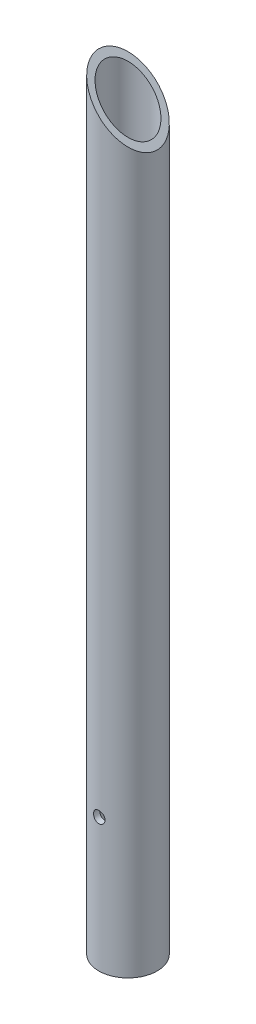
ISO-10303-21;
HEADER;
FILE_DESCRIPTION(('STEP AP214'),'2;1');
FILE_NAME('part.step','',(''),(''),'','','');
FILE_SCHEMA(('AUTOMOTIVE_DESIGN { 1 0 10303 214 1 1 1 1 }'));
ENDSEC;
DATA;
#1=APPLICATION_CONTEXT('core data for automotive mechanical design processes');
#2=APPLICATION_PROTOCOL_DEFINITION('international standard','automotive_design',2000,#1);
#3=PRODUCT_CONTEXT('',#1,'mechanical');
#4=PRODUCT('Part','Part','',(#3));
#5=PRODUCT_RELATED_PRODUCT_CATEGORY('part','',(#4));
#6=PRODUCT_DEFINITION_FORMATION('','',#4);
#7=PRODUCT_DEFINITION_CONTEXT('part definition',#1,'design');
#8=PRODUCT_DEFINITION('design','',#6,#7);
#9=PRODUCT_DEFINITION_SHAPE('','',#8);
#10=(LENGTH_UNIT() NAMED_UNIT(*) SI_UNIT(.MILLI.,.METRE.));
#11=(NAMED_UNIT(*) PLANE_ANGLE_UNIT() SI_UNIT($,.RADIAN.));
#12=(NAMED_UNIT(*) SI_UNIT($,.STERADIAN.) SOLID_ANGLE_UNIT());
#13=UNCERTAINTY_MEASURE_WITH_UNIT(LENGTH_MEASURE(1.E-05),#10,'distance_accuracy_value','');
#14=(GEOMETRIC_REPRESENTATION_CONTEXT(3) GLOBAL_UNCERTAINTY_ASSIGNED_CONTEXT((#13)) GLOBAL_UNIT_ASSIGNED_CONTEXT((#10,
#11,#12)) REPRESENTATION_CONTEXT('',''));
#15=CARTESIAN_POINT('',(0.,0.,0.));
#16=DIRECTION('',(0.,0.,1.));
#17=DIRECTION('',(1.,0.,0.));
#18=AXIS2_PLACEMENT_3D('',#15,#16,#17);
#19=CARTESIAN_POINT('',(0.,76.2,20.0406));
#20=DIRECTION('',(0.,0.,-1.));
#21=DIRECTION('',(-1.,0.,0.));
#22=AXIS2_PLACEMENT_3D('',#19,#20,#21);
#23=CYLINDRICAL_SURFACE('',#22,3.302);
#24=CARTESIAN_POINT('',(-3.302,76.2,16.3708123271266));
#25=CARTESIAN_POINT('',(-3.30199120234706,76.3833287547714,16.370816838591));
#26=CARTESIAN_POINT('',(-3.28666629725176,76.5668858268226,16.3739282706998));
#27=CARTESIAN_POINT('',(-3.22577913606345,76.9289566977053,16.386029838558));
#28=CARTESIAN_POINT('',(-3.18015678030354,77.1074597358098,16.3950316582785));
#29=CARTESIAN_POINT('',(-3.060138086062,77.4539139258851,16.4178548507634));
#30=CARTESIAN_POINT('',(-2.98578312075264,77.6218798482613,16.4316692908501));
#31=CARTESIAN_POINT('',(-2.81050949515337,77.9428962740822,16.4625519787775));
#32=CARTESIAN_POINT('',(-2.70959960391072,78.0959516785034,16.4796191519786));
#33=CARTESIAN_POINT('',(-2.48257124423567,78.3850020083973,16.5153526470844));
#34=CARTESIAN_POINT('',(-2.3561532549857,78.5207595965224,16.5340363009441));
#35=CARTESIAN_POINT('',(-2.08233848475013,78.7692922516048,16.5707457114895));
#36=CARTESIAN_POINT('',(-1.93493914218847,78.8820645082295,16.5887713875058));
#37=CARTESIAN_POINT('',(-1.62179856876697,79.0823254145867,16.6223174077456));
#38=CARTESIAN_POINT('',(-1.45591227965559,79.1695913462381,16.6378151894775));
#39=CARTESIAN_POINT('',(-1.11147589342289,79.3149245729163,16.664366705757));
#40=CARTESIAN_POINT('',(-0.932927063763604,79.3729947856064,16.6754208843524));
#41=CARTESIAN_POINT('',(-0.57067351808839,79.4575578431062,16.6917185219859));
#42=CARTESIAN_POINT('',(-0.387064848766468,79.4844478283264,16.6970349998164));
#43=CARTESIAN_POINT('',(-0.0178701767883407,79.5071258552693,16.7015103072479));
#44=CARTESIAN_POINT('',(0.167715640957956,79.5029167804259,16.7006697077192));
#45=CARTESIAN_POINT('',(0.53286669095821,79.463818088652,16.6929822544683));
#46=CARTESIAN_POINT('',(0.712479772753454,79.429356479101,16.6862191939152));
#47=CARTESIAN_POINT('',(1.06332383791853,79.3314090044509,16.6675410519917));
#48=CARTESIAN_POINT('',(1.23455442729845,79.2679217765509,16.6556257287153));
#49=CARTESIAN_POINT('',(1.56500133231594,79.1133243200546,16.6278429902022));
#50=CARTESIAN_POINT('',(1.72413639187263,79.0220449172934,16.6119514801186));
#51=CARTESIAN_POINT('',(2.02497763659662,78.8145863928103,16.5779708611867));
#52=CARTESIAN_POINT('',(2.16668314226013,78.6984063008007,16.5598816667148));
#53=CARTESIAN_POINT('',(2.43117128885855,78.4421168854028,16.5231433116127));
#54=CARTESIAN_POINT('',(2.55359464160904,78.3016371678917,16.5044898519119));
#55=CARTESIAN_POINT('',(2.77325590848956,78.0018842186074,16.4690065392469));
#56=CARTESIAN_POINT('',(2.87048261267331,77.8426026676409,16.4521774998943));
#57=CARTESIAN_POINT('',(3.03710510185893,77.5092143633048,16.4222382154061));
#58=CARTESIAN_POINT('',(3.10642109660303,77.3350668076119,16.4091386628474));
#59=CARTESIAN_POINT('',(3.2145675191706,76.9775019743356,16.3882987934198));
#60=CARTESIAN_POINT('',(3.25346223236521,76.7941051204794,16.3805471795544));
#61=CARTESIAN_POINT('',(3.28504928670894,76.5410966173695,16.3742234759928));
#62=CARTESIAN_POINT('',(3.29140035559216,76.4730478372924,16.3729472949643));
#63=CARTESIAN_POINT('',(3.29987735592536,76.3366766184731,16.3712408787632));
#64=CARTESIAN_POINT('',(3.30200328020744,76.2683541792668,16.3708106450258));
#65=CARTESIAN_POINT('',(3.30199120234706,76.0166712452285,16.370816838591));
#66=CARTESIAN_POINT('',(3.28666629725176,75.8331141731774,16.3739282706998));
#67=CARTESIAN_POINT('',(3.22577913606345,75.4710433022946,16.386029838558));
#68=CARTESIAN_POINT('',(3.18015678030354,75.2925402641902,16.3950316582785));
#69=CARTESIAN_POINT('',(3.060138086062,74.9460860741149,16.4178548507634));
#70=CARTESIAN_POINT('',(2.98578312075264,74.7781201517386,16.4316692908501));
#71=CARTESIAN_POINT('',(2.81050949515337,74.4571037259178,16.4625519787775));
#72=CARTESIAN_POINT('',(2.70959960391072,74.3040483214965,16.4796191519786));
#73=CARTESIAN_POINT('',(2.48257124423567,74.0149979916027,16.5153526470844));
#74=CARTESIAN_POINT('',(2.3561532549857,73.8792404034776,16.5340363009441));
#75=CARTESIAN_POINT('',(2.08233848475013,73.6307077483952,16.5707457114895));
#76=CARTESIAN_POINT('',(1.93493914218847,73.5179354917704,16.5887713875058));
#77=CARTESIAN_POINT('',(1.62179856876697,73.3176745854133,16.6223174077456));
#78=CARTESIAN_POINT('',(1.45591227965559,73.2304086537619,16.6378151894775));
#79=CARTESIAN_POINT('',(1.11147589342289,73.0850754270837,16.664366705757));
#80=CARTESIAN_POINT('',(0.932927063763608,73.0270052143936,16.6754208843524));
#81=CARTESIAN_POINT('',(0.570673518088389,72.9424421568937,16.6917185219859));
#82=CARTESIAN_POINT('',(0.387064848766467,72.9155521716736,16.6970349998164));
#83=CARTESIAN_POINT('',(0.0178701767883409,72.8928741447307,16.7015103072479));
#84=CARTESIAN_POINT('',(-0.167715640957956,72.8970832195741,16.7006697077192));
#85=CARTESIAN_POINT('',(-0.53286669095821,72.936181911348,16.6929822544683));
#86=CARTESIAN_POINT('',(-0.712479772753454,72.970643520899,16.6862191939152));
#87=CARTESIAN_POINT('',(-1.06332383791853,73.068590995549,16.6675410519917));
#88=CARTESIAN_POINT('',(-1.23455442729845,73.132078223449,16.6556257287153));
#89=CARTESIAN_POINT('',(-1.56500133231594,73.2866756799454,16.6278429902022));
#90=CARTESIAN_POINT('',(-1.72413639187263,73.3779550827065,16.6119514801186));
#91=CARTESIAN_POINT('',(-2.02497763659662,73.5854136071897,16.5779708611867));
#92=CARTESIAN_POINT('',(-2.16668314226013,73.7015936991992,16.5598816667148));
#93=CARTESIAN_POINT('',(-2.43117128885855,73.9578831145972,16.5231433116127));
#94=CARTESIAN_POINT('',(-2.55359464160905,74.0983628321083,16.5044898519119));
#95=CARTESIAN_POINT('',(-2.77325590848956,74.3981157813926,16.4690065392469));
#96=CARTESIAN_POINT('',(-2.87048261267331,74.557397332359,16.4521774998943));
#97=CARTESIAN_POINT('',(-3.03710510185893,74.8907856366951,16.4222382154061));
#98=CARTESIAN_POINT('',(-3.10642109660303,75.0649331923881,16.4091386628474));
#99=CARTESIAN_POINT('',(-3.21456751917059,75.4224980256644,16.3882987934198));
#100=CARTESIAN_POINT('',(-3.25346223236521,75.6058948795206,16.3805471795544));
#101=CARTESIAN_POINT('',(-3.28504928670894,75.8589033826305,16.3742234759928));
#102=CARTESIAN_POINT('',(-3.29140035559216,75.9269521627076,16.3729472949643));
#103=CARTESIAN_POINT('',(-3.29987735592536,76.0633233815269,16.3712408787632));
#104=CARTESIAN_POINT('',(-3.30200328020744,76.1316458207332,16.3708106450258));
#105=CARTESIAN_POINT('',(-3.302,76.2,16.3708123271266));
#106=B_SPLINE_CURVE_WITH_KNOTS('',3,(#24,#25,#26,#27,#28,#29,#30,#31,#32,#33,#34,#35,#36,#37,
#38,#39,#40,#41,#42,#43,#44,#45,#46,#47,#48,#49,#50,#51,#52,#53,#54,#55,#56,#57,#58,#59,#60,#61,
#62,#63,#64,#65,#66,#67,#68,#69,#70,#71,#72,#73,#74,#75,#76,#77,#78,#79,#80,#81,#82,#83,#84,#85,
#86,#87,#88,#89,#90,#91,#92,#93,#94,#95,#96,#97,#98,#99,#100,#101,#102,#103,#104,#105),
.UNSPECIFIED.,.T.,.F.,(4,2,2,2,2,2,2,2,2,2,2,2,2,2,2,2,2,2,2,2,2,2,2,2,2,2,2,2,2,2,2,2,2,2,2,2,
2,2,2,2,4),(0.,0.549724742367447,1.10054321885154,1.65057148881832,2.20041835422822,
2.7571426870942,3.31393504783329,3.8754531759231,4.43691517774535,4.99114447696647,
5.54532238995423,6.09178401127641,6.63827129251496,7.18815396349284,7.73805806525502,
8.29723279692203,8.85665587904593,9.4176670576288,9.97748949635796,10.1824541779053,
10.3874192071722,10.9371439495396,11.4879624260237,12.0379906959905,12.5878375614004,
13.1445618942664,13.7013542550055,14.2628723830953,14.8243343849175,15.3785636841387,
15.9327415971264,16.4792032184486,17.0256904996871,17.575573170665,18.1254772724272,
18.6846520040942,19.2440750862181,19.805086264801,20.3649087035302,20.5698733850775,
20.7748384143444),.UNSPECIFIED.);
#107=CARTESIAN_POINT('',(-3.302,76.2,16.3708123271266));
#108=VERTEX_POINT('',#107);
#109=EDGE_CURVE('E46',#108,#108,#106,.T.);
#110=ORIENTED_EDGE('',*,*,#109,.F.);
#111=EDGE_LOOP('',(#110));
#112=FACE_BOUND('',#111,.T.);
#113=CARTESIAN_POINT('',(3.302,76.2,12.9066058005194));
#114=CARTESIAN_POINT('',(3.30199063208015,76.0178187283405,12.9066117867371));
#115=CARTESIAN_POINT('',(3.28685540031462,75.8354219256333,12.9105096998557));
#116=CARTESIAN_POINT('',(3.22675836918239,75.4757015883572,12.9256576757505));
#117=CARTESIAN_POINT('',(3.18173992870915,75.2983883563444,12.9369216997672));
#118=CARTESIAN_POINT('',(3.0634183087209,74.9543308631637,12.9654470693106));
#119=CARTESIAN_POINT('',(2.99016565854179,74.7875683371002,12.9826976954549));
#120=CARTESIAN_POINT('',(2.8175877818168,74.4687370261311,13.021238721081));
#121=CARTESIAN_POINT('',(2.71826913298133,74.3166645474432,13.042528101015));
#122=CARTESIAN_POINT('',(2.49406009166967,74.0281594425211,13.0872697707412));
#123=CARTESIAN_POINT('',(2.3687061886504,73.8920922346542,13.110756303134));
#124=CARTESIAN_POINT('',(2.09697754820616,73.6426755238184,13.1569496859324));
#125=CARTESIAN_POINT('',(1.95059972990895,73.5293293562629,13.1796564214603));
#126=CARTESIAN_POINT('',(1.63850231056603,73.3271006156521,13.2221060045578));
#127=CARTESIAN_POINT('',(1.47254557218511,73.2385738000642,13.2418040718838));
#128=CARTESIAN_POINT('',(1.12753839690126,73.0908101391158,13.2756292981495));
#129=CARTESIAN_POINT('',(0.948489964109988,73.031568821384,13.2897573076608));
#130=CARTESIAN_POINT('',(0.58616689181204,72.9452187119843,13.3106101948568));
#131=CARTESIAN_POINT('',(0.403047532571587,72.9174932254366,13.3174769649403));
#132=CARTESIAN_POINT('',(0.0346363502121916,72.8930266113245,13.3235279332403));
#133=CARTESIAN_POINT('',(-0.150655155898091,72.8962810173437,13.3227132389048));
#134=CARTESIAN_POINT('',(-0.513873987073934,72.9332370538401,13.3135989130709));
#135=CARTESIAN_POINT('',(-0.691873781128171,72.9662728672424,13.3054629684576));
#136=CARTESIAN_POINT('',(-1.03972142896235,73.0607847958827,13.2828105218201));
#137=CARTESIAN_POINT('',(-1.20956879954739,73.1222625945881,13.2682936421141));
#138=CARTESIAN_POINT('',(-1.53805462375157,73.2724577111634,13.2342586375848));
#139=CARTESIAN_POINT('',(-1.69657917140658,73.3614138632733,13.2146969207924));
#140=CARTESIAN_POINT('',(-1.99667380698015,73.5638534090277,13.1726976383115));
#141=CARTESIAN_POINT('',(-2.13824212008747,73.6773393667294,13.150259772084));
#142=CARTESIAN_POINT('',(-2.40436498149018,73.9291692689648,13.1042530544457));
#143=CARTESIAN_POINT('',(-2.52837068734241,74.0680911481325,13.0806699855788));
#144=CARTESIAN_POINT('',(-2.75149721286467,74.3650699397459,13.035564508723));
#145=CARTESIAN_POINT('',(-2.85060696254605,74.5231353182143,13.014043020038));
#146=CARTESIAN_POINT('',(-3.02147037254645,74.8550233605018,12.9754436523584));
#147=CARTESIAN_POINT('',(-3.09307186641119,75.0289272717116,12.9583906519881));
#148=CARTESIAN_POINT('',(-3.20571768463233,75.3866164701759,12.9309886202543));
#149=CARTESIAN_POINT('',(-3.246826362328,75.570380064541,12.920625476367));
#150=CARTESIAN_POINT('',(-3.28201493247129,75.8297137601012,12.9117049788461));
#151=CARTESIAN_POINT('',(-3.28950207800369,75.9035485231215,12.9097978475782));
#152=CARTESIAN_POINT('',(-3.29949652854945,76.0515769295719,12.9072470367696));
#153=CARTESIAN_POINT('',(-3.3020038169418,76.1257705741991,12.9066033614459));
#154=CARTESIAN_POINT('',(-3.30199063208015,76.3821812716595,12.9066117867371));
#155=CARTESIAN_POINT('',(-3.28685540031462,76.5645780743666,12.9105096998557));
#156=CARTESIAN_POINT('',(-3.22675836918239,76.9242984116428,12.9256576757505));
#157=CARTESIAN_POINT('',(-3.18173992870915,77.1016116436556,12.9369216997672));
#158=CARTESIAN_POINT('',(-3.0634183087209,77.4456691368362,12.9654470693106));
#159=CARTESIAN_POINT('',(-2.99016565854179,77.6124316628997,12.9826976954549));
#160=CARTESIAN_POINT('',(-2.8175877818168,77.9312629738689,13.021238721081));
#161=CARTESIAN_POINT('',(-2.71826913298133,78.0833354525568,13.042528101015));
#162=CARTESIAN_POINT('',(-2.49406009166967,78.3718405574789,13.0872697707412));
#163=CARTESIAN_POINT('',(-2.3687061886504,78.5079077653458,13.110756303134));
#164=CARTESIAN_POINT('',(-2.09697754820616,78.7573244761816,13.1569496859324));
#165=CARTESIAN_POINT('',(-1.95059972990895,78.8706706437371,13.1796564214603));
#166=CARTESIAN_POINT('',(-1.63850231056603,79.0728993843478,13.2221060045578));
#167=CARTESIAN_POINT('',(-1.47254557218511,79.1614261999358,13.2418040718838));
#168=CARTESIAN_POINT('',(-1.12753839690126,79.3091898608841,13.2756292981495));
#169=CARTESIAN_POINT('',(-0.948489964109988,79.368431178616,13.2897573076608));
#170=CARTESIAN_POINT('',(-0.586166891812039,79.4547812880156,13.3106101948568));
#171=CARTESIAN_POINT('',(-0.403047532571586,79.4825067745634,13.3174769649403));
#172=CARTESIAN_POINT('',(-0.0346363502121906,79.5069733886754,13.3235279332403));
#173=CARTESIAN_POINT('',(0.150655155898091,79.5037189826563,13.3227132389048));
#174=CARTESIAN_POINT('',(0.513873987073934,79.4667629461598,13.3135989130709));
#175=CARTESIAN_POINT('',(0.69187378112817,79.4337271327575,13.3054629684576));
#176=CARTESIAN_POINT('',(1.03972142896235,79.3392152041172,13.2828105218201));
#177=CARTESIAN_POINT('',(1.20956879954739,79.2777374054119,13.2682936421141));
#178=CARTESIAN_POINT('',(1.53805462375157,79.1275422888366,13.2342586375848));
#179=CARTESIAN_POINT('',(1.69657917140658,79.0385861367267,13.2146969207924));
#180=CARTESIAN_POINT('',(1.99667380698015,78.8361465909723,13.1726976383115));
#181=CARTESIAN_POINT('',(2.13824212008747,78.7226606332706,13.150259772084));
#182=CARTESIAN_POINT('',(2.40436498149018,78.4708307310352,13.1042530544457));
#183=CARTESIAN_POINT('',(2.52837068734241,78.3319088518675,13.0806699855788));
#184=CARTESIAN_POINT('',(2.75149721286467,78.034930060254,13.035564508723));
#185=CARTESIAN_POINT('',(2.85060696254605,77.8768646817857,13.014043020038));
#186=CARTESIAN_POINT('',(3.02147037254645,77.5449766394982,12.9754436523584));
#187=CARTESIAN_POINT('',(3.09307186641119,77.3710727282884,12.9583906519881));
#188=CARTESIAN_POINT('',(3.20571768463233,77.0133835298241,12.9309886202543));
#189=CARTESIAN_POINT('',(3.246826362328,76.829619935459,12.920625476367));
#190=CARTESIAN_POINT('',(3.28201493247129,76.5702862398987,12.9117049788461));
#191=CARTESIAN_POINT('',(3.28950207800369,76.4964514768785,12.9097978475782));
#192=CARTESIAN_POINT('',(3.29949652854945,76.348423070428,12.9072470367696));
#193=CARTESIAN_POINT('',(3.3020038169418,76.2742294258009,12.9066033614459));
#194=CARTESIAN_POINT('',(3.302,76.2,12.9066058005194));
#195=B_SPLINE_CURVE_WITH_KNOTS('',3,(#113,#114,#115,#116,#117,#118,#119,#120,#121,#122,#123,
#124,#125,#126,#127,#128,#129,#130,#131,#132,#133,#134,#135,#136,#137,#138,#139,#140,#141,#142,
#143,#144,#145,#146,#147,#148,#149,#150,#151,#152,#153,#154,#155,#156,#157,#158,#159,#160,#161,
#162,#163,#164,#165,#166,#167,#168,#169,#170,#171,#172,#173,#174,#175,#176,#177,#178,#179,#180,
#181,#182,#183,#184,#185,#186,#187,#188,#189,#190,#191,#192,#193,#194),.UNSPECIFIED.,.T.,.F.,(4,
2,2,2,2,2,2,2,2,2,2,2,2,2,2,2,2,2,2,2,2,2,2,2,2,2,2,2,2,2,2,2,2,2,2,2,2,2,2,2,4),(0.,
0.546258625992837,1.09355560700881,1.63987763239607,2.18606192668676,2.74296298910197,
3.29994574395507,3.86454567125445,4.42905934831158,4.98232559406963,5.53551207582849,
6.07662967107866,6.61777929891613,7.16377149275347,7.7098207858137,8.27030833162596,
8.83104465886005,9.39483960114977,9.95744127453622,10.180012609345,10.4025846870173,
10.9488433130101,11.4961402940261,12.0424623194134,12.5886466137041,13.1455476761193,
13.7025304309724,14.2671303582718,14.8316440353289,15.3849102810869,15.9380967628458,
16.479214358096,17.0203639859334,17.5663561797708,18.112405472831,18.6728930186433,
19.2336293458774,19.7974242881671,20.3600259615535,20.5825972963623,20.8051693740346),.UNSPECIFIED.);
#196=CARTESIAN_POINT('',(3.302,76.2,12.9066058005194));
#197=VERTEX_POINT('',#196);
#198=EDGE_CURVE('E19',#197,#197,#195,.T.);
#199=ORIENTED_EDGE('',*,*,#198,.T.);
#200=EDGE_LOOP('',(#199));
#201=FACE_BOUND('',#200,.T.);
#202=ADVANCED_FACE('F15',(#112,#201),#23,.F.);
#203=CARTESIAN_POINT('',(0.,0.,0.));
#204=DIRECTION('',(0.,1.,0.));
#205=DIRECTION('',(0.,0.,1.));
#206=AXIS2_PLACEMENT_3D('',#203,#204,#205);
#207=CYLINDRICAL_SURFACE('',#206,13.3223);
#208=CARTESIAN_POINT('',(0.,0.,0.));
#209=DIRECTION('',(0.,1.,0.));
#210=DIRECTION('',(0.,0.,1.));
#211=AXIS2_PLACEMENT_3D('',#208,#209,#210);
#212=CIRCLE('',#211,13.3223);
#213=CARTESIAN_POINT('',(0.,0.,13.3223));
#214=VERTEX_POINT('',#213);
#215=EDGE_CURVE('E52',#214,#214,#212,.F.);
#216=ORIENTED_EDGE('',*,*,#215,.T.);
#217=EDGE_LOOP('',(#216));
#218=FACE_BOUND('',#217,.T.);
#219=CARTESIAN_POINT('',(-3.302,76.2,-12.9066058005194));
#220=CARTESIAN_POINT('',(-3.30199063208015,76.3821812716595,-12.9066117867371));
#221=CARTESIAN_POINT('',(-3.28685540031461,76.5645780743667,-12.9105096998557));
#222=CARTESIAN_POINT('',(-3.22675836918239,76.9242984116428,-12.9256576757505));
#223=CARTESIAN_POINT('',(-3.18173992870915,77.1016116436556,-12.9369216997672));
#224=CARTESIAN_POINT('',(-3.0634183087209,77.4456691368362,-12.9654470693106));
#225=CARTESIAN_POINT('',(-2.99016565854179,77.6124316628997,-12.9826976954549));
#226=CARTESIAN_POINT('',(-2.8175877818168,77.9312629738689,-13.021238721081));
#227=CARTESIAN_POINT('',(-2.71826913298133,78.0833354525568,-13.042528101015));
#228=CARTESIAN_POINT('',(-2.49406009166967,78.3718405574789,-13.0872697707412));
#229=CARTESIAN_POINT('',(-2.3687061886504,78.5079077653458,-13.110756303134));
#230=CARTESIAN_POINT('',(-2.09697754820616,78.7573244761816,-13.1569496859324));
#231=CARTESIAN_POINT('',(-1.95059972990895,78.8706706437371,-13.1796564214603));
#232=CARTESIAN_POINT('',(-1.63850231056603,79.0728993843478,-13.2221060045578));
#233=CARTESIAN_POINT('',(-1.47254557218511,79.1614261999358,-13.2418040718838));
#234=CARTESIAN_POINT('',(-1.12753839690126,79.3091898608841,-13.2756292981495));
#235=CARTESIAN_POINT('',(-0.948489964109988,79.368431178616,-13.2897573076608));
#236=CARTESIAN_POINT('',(-0.58616689181204,79.4547812880156,-13.3106101948568));
#237=CARTESIAN_POINT('',(-0.403047532571587,79.4825067745634,-13.3174769649403));
#238=CARTESIAN_POINT('',(-0.0346363502121916,79.5069733886754,-13.3235279332403));
#239=CARTESIAN_POINT('',(0.150655155898091,79.5037189826563,-13.3227132389048));
#240=CARTESIAN_POINT('',(0.513873987073934,79.4667629461598,-13.3135989130709));
#241=CARTESIAN_POINT('',(0.691873781128171,79.4337271327575,-13.3054629684576));
#242=CARTESIAN_POINT('',(1.03972142896235,79.3392152041172,-13.2828105218201));
#243=CARTESIAN_POINT('',(1.20956879954739,79.2777374054119,-13.2682936421141));
#244=CARTESIAN_POINT('',(1.53805462375157,79.1275422888366,-13.2342586375848));
#245=CARTESIAN_POINT('',(1.69657917140658,79.0385861367267,-13.2146969207924));
#246=CARTESIAN_POINT('',(1.99667380698015,78.8361465909723,-13.1726976383115));
#247=CARTESIAN_POINT('',(2.13824212008747,78.7226606332706,-13.150259772084));
#248=CARTESIAN_POINT('',(2.40436498149018,78.4708307310352,-13.1042530544457));
#249=CARTESIAN_POINT('',(2.52837068734241,78.3319088518675,-13.0806699855788));
#250=CARTESIAN_POINT('',(2.75149721286467,78.034930060254,-13.035564508723));
#251=CARTESIAN_POINT('',(2.85060696254605,77.8768646817857,-13.014043020038));
#252=CARTESIAN_POINT('',(3.02147037254645,77.5449766394982,-12.9754436523584));
#253=CARTESIAN_POINT('',(3.09307186641119,77.3710727282884,-12.9583906519881));
#254=CARTESIAN_POINT('',(3.20571768463233,77.0133835298241,-12.9309886202543));
#255=CARTESIAN_POINT('',(3.246826362328,76.829619935459,-12.920625476367));
#256=CARTESIAN_POINT('',(3.28201493247129,76.5702862398987,-12.9117049788461));
#257=CARTESIAN_POINT('',(3.28950207800369,76.4964514768785,-12.9097978475782));
#258=CARTESIAN_POINT('',(3.29949652854945,76.348423070428,-12.9072470367696));
#259=CARTESIAN_POINT('',(3.3020038169418,76.2742294258009,-12.9066033614459));
#260=CARTESIAN_POINT('',(3.30199063208015,76.0178187283405,-12.9066117867371));
#261=CARTESIAN_POINT('',(3.28685540031461,75.8354219256333,-12.9105096998557));
#262=CARTESIAN_POINT('',(3.22675836918239,75.4757015883572,-12.9256576757505));
#263=CARTESIAN_POINT('',(3.18173992870915,75.2983883563444,-12.9369216997672));
#264=CARTESIAN_POINT('',(3.0634183087209,74.9543308631637,-12.9654470693106));
#265=CARTESIAN_POINT('',(2.99016565854179,74.7875683371002,-12.9826976954549));
#266=CARTESIAN_POINT('',(2.8175877818168,74.4687370261311,-13.021238721081));
#267=CARTESIAN_POINT('',(2.71826913298133,74.3166645474432,-13.042528101015));
#268=CARTESIAN_POINT('',(2.49406009166967,74.0281594425211,-13.0872697707412));
#269=CARTESIAN_POINT('',(2.3687061886504,73.8920922346542,-13.110756303134));
#270=CARTESIAN_POINT('',(2.09697754820616,73.6426755238184,-13.1569496859324));
#271=CARTESIAN_POINT('',(1.95059972990895,73.5293293562629,-13.1796564214603));
#272=CARTESIAN_POINT('',(1.63850231056603,73.3271006156521,-13.2221060045578));
#273=CARTESIAN_POINT('',(1.47254557218511,73.2385738000642,-13.2418040718838));
#274=CARTESIAN_POINT('',(1.12753839690126,73.0908101391158,-13.2756292981495));
#275=CARTESIAN_POINT('',(0.948489964109988,73.031568821384,-13.2897573076608));
#276=CARTESIAN_POINT('',(0.586166891812039,72.9452187119843,-13.3106101948568));
#277=CARTESIAN_POINT('',(0.403047532571586,72.9174932254366,-13.3174769649403));
#278=CARTESIAN_POINT('',(0.0346363502121906,72.8930266113245,-13.3235279332403));
#279=CARTESIAN_POINT('',(-0.150655155898092,72.8962810173437,-13.3227132389048));
#280=CARTESIAN_POINT('',(-0.513873987073932,72.9332370538401,-13.3135989130709));
#281=CARTESIAN_POINT('',(-0.691873781128165,72.9662728672424,-13.3054629684576));
#282=CARTESIAN_POINT('',(-1.03972142896235,73.0607847958827,-13.2828105218201));
#283=CARTESIAN_POINT('',(-1.20956879954739,73.1222625945881,-13.2682936421141));
#284=CARTESIAN_POINT('',(-1.53805462375157,73.2724577111634,-13.2342586375848));
#285=CARTESIAN_POINT('',(-1.69657917140657,73.3614138632733,-13.2146969207924));
#286=CARTESIAN_POINT('',(-1.99667380698014,73.5638534090277,-13.1726976383115));
#287=CARTESIAN_POINT('',(-2.13824212008747,73.6773393667294,-13.150259772084));
#288=CARTESIAN_POINT('',(-2.40436498149018,73.9291692689648,-13.1042530544457));
#289=CARTESIAN_POINT('',(-2.52837068734241,74.0680911481325,-13.0806699855788));
#290=CARTESIAN_POINT('',(-2.75149721286467,74.3650699397459,-13.035564508723));
#291=CARTESIAN_POINT('',(-2.85060696254605,74.5231353182143,-13.014043020038));
#292=CARTESIAN_POINT('',(-3.02147037254645,74.8550233605018,-12.9754436523584));
#293=CARTESIAN_POINT('',(-3.09307186641119,75.0289272717116,-12.9583906519881));
#294=CARTESIAN_POINT('',(-3.20571768463233,75.3866164701759,-12.9309886202543));
#295=CARTESIAN_POINT('',(-3.246826362328,75.570380064541,-12.920625476367));
#296=CARTESIAN_POINT('',(-3.28201493247129,75.8297137601012,-12.9117049788461));
#297=CARTESIAN_POINT('',(-3.28950207800369,75.9035485231215,-12.9097978475782));
#298=CARTESIAN_POINT('',(-3.29949652854945,76.0515769295719,-12.9072470367696));
#299=CARTESIAN_POINT('',(-3.3020038169418,76.1257705741991,-12.9066033614459));
#300=CARTESIAN_POINT('',(-3.302,76.2,-12.9066058005194));
#301=B_SPLINE_CURVE_WITH_KNOTS('',3,(#219,#220,#221,#222,#223,#224,#225,#226,#227,#228,#229,
#230,#231,#232,#233,#234,#235,#236,#237,#238,#239,#240,#241,#242,#243,#244,#245,#246,#247,#248,
#249,#250,#251,#252,#253,#254,#255,#256,#257,#258,#259,#260,#261,#262,#263,#264,#265,#266,#267,
#268,#269,#270,#271,#272,#273,#274,#275,#276,#277,#278,#279,#280,#281,#282,#283,#284,#285,#286,
#287,#288,#289,#290,#291,#292,#293,#294,#295,#296,#297,#298,#299,#300),.UNSPECIFIED.,.T.,.F.,(4,
2,2,2,2,2,2,2,2,2,2,2,2,2,2,2,2,2,2,2,2,2,2,2,2,2,2,2,2,2,2,2,2,2,2,2,2,2,2,2,4),(0.,
0.546258625992851,1.09355560700881,1.63987763239607,2.18606192668676,2.74296298910197,
3.29994574395507,3.86454567125445,4.42905934831158,4.98232559406963,5.53551207582849,
6.07662967107866,6.61777929891613,7.16377149275347,7.7098207858137,8.27030833162596,
8.83104465886005,9.39483960114977,9.95744127453622,10.180012609345,10.4025846870173,
10.9488433130102,11.4961402940261,12.0424623194134,12.5886466137041,13.1455476761193,
13.7025304309724,14.2671303582718,14.8316440353289,15.3849102810869,15.9380967628458,
16.479214358096,17.0203639859334,17.5663561797708,18.112405472831,18.6728930186433,
19.2336293458774,19.7974242881671,20.3600259615535,20.5825972963623,20.8051693740346),.UNSPECIFIED.);
#302=CARTESIAN_POINT('',(-3.302,76.2,-12.9066058005194));
#303=VERTEX_POINT('',#302);
#304=EDGE_CURVE('E76',#303,#303,#301,.T.);
#305=ORIENTED_EDGE('',*,*,#304,.T.);
#306=EDGE_LOOP('',(#305));
#307=FACE_BOUND('',#306,.T.);
#308=CARTESIAN_POINT('',(0.,423.1005,0.));
#309=DIRECTION('',(-0.707106781186548,-0.707106781186548,0.));
#310=DIRECTION('',(-0.707106781186548,0.707106781186548,0.));
#311=AXIS2_PLACEMENT_3D('',#308,#309,#310);
#312=ELLIPSE('',#311,18.8405773420031,13.3223);
#313=CARTESIAN_POINT('',(-13.3223,436.4228,0.));
#314=VERTEX_POINT('',#313);
#315=EDGE_CURVE('E51',#314,#314,#312,.F.);
#316=ORIENTED_EDGE('',*,*,#315,.T.);
#317=EDGE_LOOP('',(#316));
#318=FACE_BOUND('',#317,.T.);
#319=ORIENTED_EDGE('',*,*,#198,.F.);
#320=EDGE_LOOP('',(#319));
#321=FACE_BOUND('',#320,.T.);
#322=ADVANCED_FACE('F61',(#218,#307,#318,#321),#207,.F.);
#323=CARTESIAN_POINT('',(0.,0.,0.));
#324=DIRECTION('',(0.,1.,0.));
#325=DIRECTION('',(0.,0.,1.));
#326=AXIS2_PLACEMENT_3D('',#323,#324,#325);
#327=PLANE('',#326);
#328=ORIENTED_EDGE('',*,*,#215,.F.);
#329=EDGE_LOOP('',(#328));
#330=FACE_BOUND('',#329,.T.);
#331=CARTESIAN_POINT('',(0.,0.,0.));
#332=DIRECTION('',(0.,1.,0.));
#333=DIRECTION('',(0.,0.,1.));
#334=AXIS2_PLACEMENT_3D('',#331,#332,#333);
#335=CIRCLE('',#334,16.7005);
#336=CARTESIAN_POINT('',(0.,0.,16.7005));
#337=VERTEX_POINT('',#336);
#338=EDGE_CURVE('E30',#337,#337,#335,.T.);
#339=ORIENTED_EDGE('',*,*,#338,.F.);
#340=EDGE_LOOP('',(#339));
#341=FACE_BOUND('',#340,.T.);
#342=ADVANCED_FACE('F63',(#330,#341),#327,.F.);
#343=CARTESIAN_POINT('',(-16.7005,439.801,-55.2958));
#344=DIRECTION('',(-0.707106781186548,-0.707106781186548,0.));
#345=DIRECTION('',(0.707106781186548,-0.707106781186548,0.));
#346=AXIS2_PLACEMENT_3D('',#343,#344,#345);
#347=PLANE('',#346);
#348=ORIENTED_EDGE('',*,*,#315,.F.);
#349=EDGE_LOOP('',(#348));
#350=FACE_BOUND('',#349,.T.);
#351=CARTESIAN_POINT('',(0.,423.1005,0.));
#352=DIRECTION('',(-0.707106781186548,-0.707106781186548,0.));
#353=DIRECTION('',(-0.707106781186548,0.707106781186548,0.));
#354=AXIS2_PLACEMENT_3D('',#351,#352,#353);
#355=ELLIPSE('',#354,23.6180735984119,16.7005);
#356=CARTESIAN_POINT('',(-16.7005,439.801,0.));
#357=VERTEX_POINT('',#356);
#358=EDGE_CURVE('E25',#357,#357,#355,.T.);
#359=ORIENTED_EDGE('',*,*,#358,.F.);
#360=EDGE_LOOP('',(#359));
#361=FACE_BOUND('',#360,.T.);
#362=ADVANCED_FACE('F69',(#350,#361),#347,.F.);
#363=CARTESIAN_POINT('',(0.,76.2,20.0406));
#364=DIRECTION('',(0.,0.,-1.));
#365=DIRECTION('',(-1.,0.,0.));
#366=AXIS2_PLACEMENT_3D('',#363,#364,#365);
#367=CYLINDRICAL_SURFACE('',#366,3.302);
#368=CARTESIAN_POINT('',(-3.302,76.2,-16.3708123271266));
#369=CARTESIAN_POINT('',(-3.30199120234706,76.0166712452285,-16.370816838591));
#370=CARTESIAN_POINT('',(-3.28666629725176,75.8331141731774,-16.3739282706998));
#371=CARTESIAN_POINT('',(-3.22577913606345,75.4710433022946,-16.386029838558));
#372=CARTESIAN_POINT('',(-3.18015678030354,75.2925402641902,-16.3950316582785));
#373=CARTESIAN_POINT('',(-3.060138086062,74.9460860741149,-16.4178548507634));
#374=CARTESIAN_POINT('',(-2.98578312075264,74.7781201517386,-16.4316692908501));
#375=CARTESIAN_POINT('',(-2.81050949515337,74.4571037259178,-16.4625519787775));
#376=CARTESIAN_POINT('',(-2.70959960391072,74.3040483214965,-16.4796191519786));
#377=CARTESIAN_POINT('',(-2.48257124423567,74.0149979916027,-16.5153526470844));
#378=CARTESIAN_POINT('',(-2.3561532549857,73.8792404034776,-16.5340363009441));
#379=CARTESIAN_POINT('',(-2.08233848475013,73.6307077483952,-16.5707457114895));
#380=CARTESIAN_POINT('',(-1.93493914218847,73.5179354917704,-16.5887713875058));
#381=CARTESIAN_POINT('',(-1.62179856876697,73.3176745854133,-16.6223174077456));
#382=CARTESIAN_POINT('',(-1.45591227965559,73.2304086537619,-16.6378151894775));
#383=CARTESIAN_POINT('',(-1.11147589342289,73.0850754270837,-16.664366705757));
#384=CARTESIAN_POINT('',(-0.932927063763606,73.0270052143936,-16.6754208843524));
#385=CARTESIAN_POINT('',(-0.570673518088389,72.9424421568937,-16.6917185219859));
#386=CARTESIAN_POINT('',(-0.387064848766467,72.9155521716736,-16.6970349998164));
#387=CARTESIAN_POINT('',(-0.0178701767883408,72.8928741447307,-16.7015103072479));
#388=CARTESIAN_POINT('',(0.167715640957956,72.8970832195741,-16.7006697077192));
#389=CARTESIAN_POINT('',(0.53286669095821,72.936181911348,-16.6929822544683));
#390=CARTESIAN_POINT('',(0.712479772753454,72.970643520899,-16.6862191939152));
#391=CARTESIAN_POINT('',(1.06332383791853,73.068590995549,-16.6675410519917));
#392=CARTESIAN_POINT('',(1.23455442729845,73.132078223449,-16.6556257287153));
#393=CARTESIAN_POINT('',(1.56500133231594,73.2866756799454,-16.6278429902022));
#394=CARTESIAN_POINT('',(1.72413639187263,73.3779550827065,-16.6119514801186));
#395=CARTESIAN_POINT('',(2.02497763659662,73.5854136071897,-16.5779708611867));
#396=CARTESIAN_POINT('',(2.16668314226013,73.7015936991992,-16.5598816667148));
#397=CARTESIAN_POINT('',(2.43117128885855,73.9578831145972,-16.5231433116127));
#398=CARTESIAN_POINT('',(2.55359464160905,74.0983628321083,-16.5044898519119));
#399=CARTESIAN_POINT('',(2.77325590848956,74.3981157813926,-16.4690065392469));
#400=CARTESIAN_POINT('',(2.87048261267331,74.557397332359,-16.4521774998943));
#401=CARTESIAN_POINT('',(3.03710510185893,74.8907856366951,-16.4222382154061));
#402=CARTESIAN_POINT('',(3.10642109660303,75.0649331923881,-16.4091386628474));
#403=CARTESIAN_POINT('',(3.21456751917059,75.4224980256644,-16.3882987934198));
#404=CARTESIAN_POINT('',(3.25346223236521,75.6058948795206,-16.3805471795544));
#405=CARTESIAN_POINT('',(3.28504928670894,75.8589033826305,-16.3742234759928));
#406=CARTESIAN_POINT('',(3.29140035559216,75.9269521627076,-16.3729472949643));
#407=CARTESIAN_POINT('',(3.29987735592536,76.0633233815269,-16.3712408787632));
#408=CARTESIAN_POINT('',(3.30200328020744,76.1316458207332,-16.3708106450258));
#409=CARTESIAN_POINT('',(3.30199120234706,76.3833287547714,-16.370816838591));
#410=CARTESIAN_POINT('',(3.28666629725176,76.5668858268226,-16.3739282706998));
#411=CARTESIAN_POINT('',(3.22577913606345,76.9289566977053,-16.386029838558));
#412=CARTESIAN_POINT('',(3.18015678030354,77.1074597358098,-16.3950316582785));
#413=CARTESIAN_POINT('',(3.060138086062,77.4539139258851,-16.4178548507634));
#414=CARTESIAN_POINT('',(2.98578312075264,77.6218798482613,-16.4316692908501));
#415=CARTESIAN_POINT('',(2.81050949515337,77.9428962740822,-16.4625519787775));
#416=CARTESIAN_POINT('',(2.70959960391072,78.0959516785034,-16.4796191519786));
#417=CARTESIAN_POINT('',(2.48257124423567,78.3850020083973,-16.5153526470844));
#418=CARTESIAN_POINT('',(2.35615325498569,78.5207595965224,-16.5340363009441));
#419=CARTESIAN_POINT('',(2.08233848475013,78.7692922516048,-16.5707457114895));
#420=CARTESIAN_POINT('',(1.93493914218846,78.8820645082295,-16.5887713875058));
#421=CARTESIAN_POINT('',(1.62179856876697,79.0823254145867,-16.6223174077456));
#422=CARTESIAN_POINT('',(1.45591227965559,79.1695913462381,-16.6378151894775));
#423=CARTESIAN_POINT('',(1.11147589342289,79.3149245729163,-16.664366705757));
#424=CARTESIAN_POINT('',(0.932927063763607,79.3729947856064,-16.6754208843524));
#425=CARTESIAN_POINT('',(0.570673518088389,79.4575578431062,-16.6917185219859));
#426=CARTESIAN_POINT('',(0.387064848766467,79.4844478283264,-16.6970349998164));
#427=CARTESIAN_POINT('',(0.0178701767883408,79.5071258552693,-16.7015103072479));
#428=CARTESIAN_POINT('',(-0.167715640957956,79.5029167804259,-16.7006697077192));
#429=CARTESIAN_POINT('',(-0.53286669095821,79.463818088652,-16.6929822544683));
#430=CARTESIAN_POINT('',(-0.712479772753454,79.429356479101,-16.6862191939152));
#431=CARTESIAN_POINT('',(-1.06332383791853,79.3314090044509,-16.6675410519917));
#432=CARTESIAN_POINT('',(-1.23455442729845,79.2679217765509,-16.6556257287153));
#433=CARTESIAN_POINT('',(-1.56500133231594,79.1133243200546,-16.6278429902022));
#434=CARTESIAN_POINT('',(-1.72413639187263,79.0220449172934,-16.6119514801186));
#435=CARTESIAN_POINT('',(-2.02497763659662,78.8145863928103,-16.5779708611867));
#436=CARTESIAN_POINT('',(-2.16668314226013,78.6984063008007,-16.5598816667148));
#437=CARTESIAN_POINT('',(-2.43117128885855,78.4421168854028,-16.5231433116127));
#438=CARTESIAN_POINT('',(-2.55359464160905,78.3016371678917,-16.5044898519119));
#439=CARTESIAN_POINT('',(-2.77325590848957,78.0018842186074,-16.4690065392469));
#440=CARTESIAN_POINT('',(-2.87048261267331,77.8426026676409,-16.4521774998943));
#441=CARTESIAN_POINT('',(-3.03710510185893,77.5092143633048,-16.4222382154061));
#442=CARTESIAN_POINT('',(-3.10642109660304,77.3350668076119,-16.4091386628474));
#443=CARTESIAN_POINT('',(-3.2145675191706,76.9775019743356,-16.3882987934198));
#444=CARTESIAN_POINT('',(-3.25346223236521,76.7941051204794,-16.3805471795544));
#445=CARTESIAN_POINT('',(-3.28504928670894,76.5410966173695,-16.3742234759928));
#446=CARTESIAN_POINT('',(-3.29140035559216,76.4730478372924,-16.3729472949643));
#447=CARTESIAN_POINT('',(-3.29987735592536,76.3366766184731,-16.3712408787632));
#448=CARTESIAN_POINT('',(-3.30200328020744,76.2683541792668,-16.3708106450258));
#449=CARTESIAN_POINT('',(-3.302,76.2,-16.3708123271266));
#450=B_SPLINE_CURVE_WITH_KNOTS('',3,(#368,#369,#370,#371,#372,#373,#374,#375,#376,#377,#378,
#379,#380,#381,#382,#383,#384,#385,#386,#387,#388,#389,#390,#391,#392,#393,#394,#395,#396,#397,
#398,#399,#400,#401,#402,#403,#404,#405,#406,#407,#408,#409,#410,#411,#412,#413,#414,#415,#416,
#417,#418,#419,#420,#421,#422,#423,#424,#425,#426,#427,#428,#429,#430,#431,#432,#433,#434,#435,
#436,#437,#438,#439,#440,#441,#442,#443,#444,#445,#446,#447,#448,#449),.UNSPECIFIED.,.T.,.F.,(4,
2,2,2,2,2,2,2,2,2,2,2,2,2,2,2,2,2,2,2,2,2,2,2,2,2,2,2,2,2,2,2,2,2,2,2,2,2,2,2,4),(0.,
0.549724742367447,1.10054321885154,1.65057148881832,2.20041835422822,2.7571426870942,
3.31393504783329,3.8754531759231,4.43691517774535,4.99114447696647,5.54532238995423,
6.09178401127641,6.63827129251496,7.18815396349284,7.73805806525502,8.29723279692205,
8.85665587904593,9.4176670576288,9.97748949635796,10.1824541779053,10.3874192071722,
10.9371439495396,11.4879624260237,12.0379906959905,12.5878375614004,13.1445618942664,
13.7013542550055,14.2628723830953,14.8243343849175,15.3785636841387,15.9327415971264,
16.4792032184486,17.0256904996871,17.575573170665,18.1254772724272,18.6846520040942,
19.2440750862181,19.805086264801,20.3649087035301,20.5698733850775,20.7748384143444),.UNSPECIFIED.);
#451=CARTESIAN_POINT('',(-3.302,76.2,-16.3708123271266));
#452=VERTEX_POINT('',#451);
#453=EDGE_CURVE('E10',#452,#452,#450,.T.);
#454=ORIENTED_EDGE('',*,*,#453,.F.);
#455=EDGE_LOOP('',(#454));
#456=FACE_BOUND('',#455,.T.);
#457=ORIENTED_EDGE('',*,*,#304,.F.);
#458=EDGE_LOOP('',(#457));
#459=FACE_BOUND('',#458,.T.);
#460=ADVANCED_FACE('F37',(#456,#459),#367,.F.);
#461=CARTESIAN_POINT('',(0.,0.,0.));
#462=DIRECTION('',(0.,1.,0.));
#463=DIRECTION('',(0.,0.,1.));
#464=AXIS2_PLACEMENT_3D('',#461,#462,#463);
#465=CYLINDRICAL_SURFACE('',#464,16.7005);
#466=ORIENTED_EDGE('',*,*,#338,.T.);
#467=EDGE_LOOP('',(#466));
#468=FACE_BOUND('',#467,.T.);
#469=ORIENTED_EDGE('',*,*,#453,.T.);
#470=EDGE_LOOP('',(#469));
#471=FACE_BOUND('',#470,.T.);
#472=ORIENTED_EDGE('',*,*,#358,.T.);
#473=EDGE_LOOP('',(#472));
#474=FACE_BOUND('',#473,.T.);
#475=ORIENTED_EDGE('',*,*,#109,.T.);
#476=EDGE_LOOP('',(#475));
#477=FACE_BOUND('',#476,.T.);
#478=ADVANCED_FACE('F40',(#468,#471,#474,#477),#465,.T.);
#479=CLOSED_SHELL('',(#202,#322,#342,#362,#460,#478));
#480=MANIFOLD_SOLID_BREP('B1',#479);
#481=ADVANCED_BREP_SHAPE_REPRESENTATION('',(#18,#480),#14);
#482=SHAPE_DEFINITION_REPRESENTATION(#9,#481);
ENDSEC;
END-ISO-10303-21;
